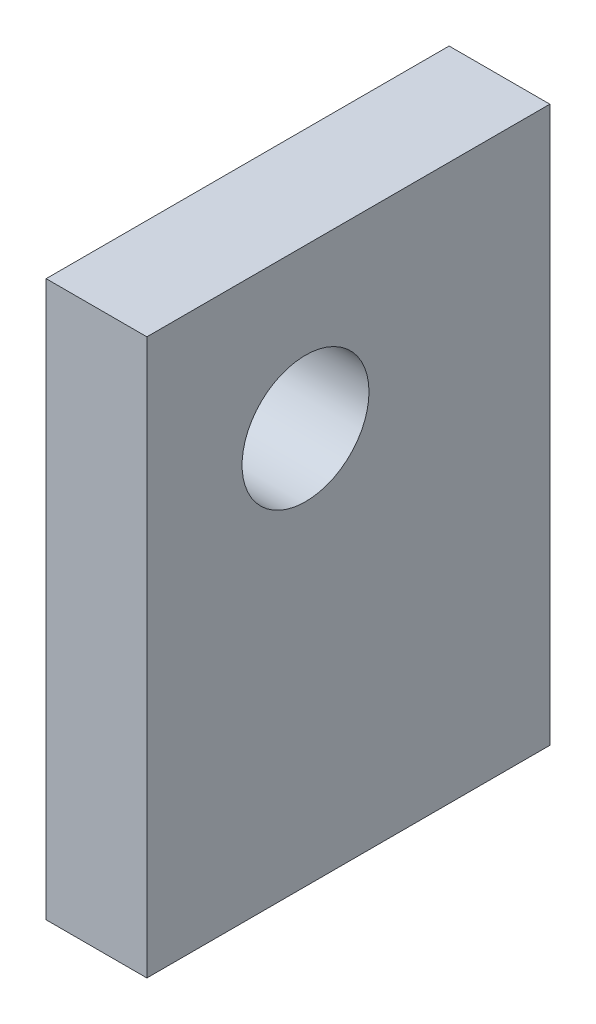
ISO-10303-21;
HEADER;
FILE_DESCRIPTION(('STEP AP214'),'2;1');
FILE_NAME('part.step','',(''),(''),'','','');
FILE_SCHEMA(('AUTOMOTIVE_DESIGN { 1 0 10303 214 1 1 1 1 }'));
ENDSEC;
DATA;
#1=APPLICATION_CONTEXT('core data for automotive mechanical design processes');
#2=APPLICATION_PROTOCOL_DEFINITION('international standard','automotive_design',2000,#1);
#3=PRODUCT_CONTEXT('',#1,'mechanical');
#4=PRODUCT('Part','Part','',(#3));
#5=PRODUCT_RELATED_PRODUCT_CATEGORY('part','',(#4));
#6=PRODUCT_DEFINITION_FORMATION('','',#4);
#7=PRODUCT_DEFINITION_CONTEXT('part definition',#1,'design');
#8=PRODUCT_DEFINITION('design','',#6,#7);
#9=PRODUCT_DEFINITION_SHAPE('','',#8);
#10=(LENGTH_UNIT() NAMED_UNIT(*) SI_UNIT(.MILLI.,.METRE.));
#11=(NAMED_UNIT(*) PLANE_ANGLE_UNIT() SI_UNIT($,.RADIAN.));
#12=(NAMED_UNIT(*) SI_UNIT($,.STERADIAN.) SOLID_ANGLE_UNIT());
#13=UNCERTAINTY_MEASURE_WITH_UNIT(LENGTH_MEASURE(1.E-05),#10,'distance_accuracy_value','');
#14=(GEOMETRIC_REPRESENTATION_CONTEXT(3) GLOBAL_UNCERTAINTY_ASSIGNED_CONTEXT((#13)) GLOBAL_UNIT_ASSIGNED_CONTEXT((#10,
#11,#12)) REPRESENTATION_CONTEXT('',''));
#15=CARTESIAN_POINT('',(0.,0.,0.));
#16=DIRECTION('',(0.,0.,1.));
#17=DIRECTION('',(1.,0.,0.));
#18=AXIS2_PLACEMENT_3D('',#15,#16,#17);
#19=CARTESIAN_POINT('',(0.,140.,0.));
#20=DIRECTION('',(1.,0.,0.));
#21=DIRECTION('',(0.,0.,-1.));
#22=AXIS2_PLACEMENT_3D('',#19,#20,#21);
#23=PLANE('',#22);
#24=CARTESIAN_POINT('',(0.,100.,-40.));
#25=DIRECTION('',(1.,0.,0.));
#26=DIRECTION('',(0.,0.,-1.));
#27=AXIS2_PLACEMENT_3D('',#24,#25,#26);
#28=CIRCLE('',#27,16.);
#29=CARTESIAN_POINT('',(0.,100.,-56.));
#30=VERTEX_POINT('',#29);
#31=EDGE_CURVE('E97',#30,#30,#28,.T.);
#32=ORIENTED_EDGE('',*,*,#31,.T.);
#33=EDGE_LOOP('',(#32));
#34=FACE_BOUND('',#33,.T.);
#35=DIRECTION('',(0.,0.,1.));
#36=VECTOR('',#35,1.);
#37=CARTESIAN_POINT('',(0.,0.,0.));
#38=LINE('',#37,#36);
#39=CARTESIAN_POINT('',(0.,0.,-101.6));
#40=VERTEX_POINT('',#39);
#41=CARTESIAN_POINT('',(0.,0.,0.));
#42=VERTEX_POINT('',#41);
#43=EDGE_CURVE('E94',#40,#42,#38,.T.);
#44=ORIENTED_EDGE('',*,*,#43,.T.);
#45=DIRECTION('',(0.,-1.,0.));
#46=VECTOR('',#45,1.);
#47=CARTESIAN_POINT('',(0.,140.,0.));
#48=LINE('',#47,#46);
#49=CARTESIAN_POINT('',(0.,140.,0.));
#50=VERTEX_POINT('',#49);
#51=EDGE_CURVE('E11',#50,#42,#48,.T.);
#52=ORIENTED_EDGE('',*,*,#51,.F.);
#53=DIRECTION('',(0.,0.,1.));
#54=VECTOR('',#53,1.);
#55=CARTESIAN_POINT('',(0.,140.,0.));
#56=LINE('',#55,#54);
#57=CARTESIAN_POINT('',(0.,140.,-101.6));
#58=VERTEX_POINT('',#57);
#59=EDGE_CURVE('E82',#58,#50,#56,.T.);
#60=ORIENTED_EDGE('',*,*,#59,.F.);
#61=DIRECTION('',(0.,-1.,0.));
#62=VECTOR('',#61,1.);
#63=CARTESIAN_POINT('',(0.,140.,-101.6));
#64=LINE('',#63,#62);
#65=EDGE_CURVE('E90',#58,#40,#64,.T.);
#66=ORIENTED_EDGE('',*,*,#65,.T.);
#67=EDGE_LOOP('',(#44,#52,#60,#66));
#68=FACE_BOUND('',#67,.T.);
#69=ADVANCED_FACE('F31',(#34,#68),#23,.F.);
#70=CARTESIAN_POINT('',(0.,140.,0.));
#71=DIRECTION('',(0.,0.,-1.));
#72=DIRECTION('',(-1.,0.,0.));
#73=AXIS2_PLACEMENT_3D('',#70,#71,#72);
#74=PLANE('',#73);
#75=DIRECTION('',(1.,0.,0.));
#76=VECTOR('',#75,1.);
#77=CARTESIAN_POINT('',(0.,0.,0.));
#78=LINE('',#77,#76);
#79=CARTESIAN_POINT('',(25.4,0.,0.));
#80=VERTEX_POINT('',#79);
#81=EDGE_CURVE('E86',#42,#80,#78,.T.);
#82=ORIENTED_EDGE('',*,*,#81,.T.);
#83=DIRECTION('',(0.,-1.,0.));
#84=VECTOR('',#83,1.);
#85=CARTESIAN_POINT('',(25.4,140.,0.));
#86=LINE('',#85,#84);
#87=CARTESIAN_POINT('',(25.4,140.,0.));
#88=VERTEX_POINT('',#87);
#89=EDGE_CURVE('E39',#88,#80,#86,.T.);
#90=ORIENTED_EDGE('',*,*,#89,.F.);
#91=DIRECTION('',(1.,0.,0.));
#92=VECTOR('',#91,1.);
#93=CARTESIAN_POINT('',(0.,140.,0.));
#94=LINE('',#93,#92);
#95=EDGE_CURVE('E77',#50,#88,#94,.T.);
#96=ORIENTED_EDGE('',*,*,#95,.F.);
#97=ORIENTED_EDGE('',*,*,#51,.T.);
#98=EDGE_LOOP('',(#82,#90,#96,#97));
#99=FACE_BOUND('',#98,.T.);
#100=ADVANCED_FACE('F85',(#99),#74,.F.);
#101=CARTESIAN_POINT('',(25.4,140.,0.));
#102=DIRECTION('',(-1.,0.,0.));
#103=DIRECTION('',(0.,0.,1.));
#104=AXIS2_PLACEMENT_3D('',#101,#102,#103);
#105=PLANE('',#104);
#106=CARTESIAN_POINT('',(25.4,100.,-40.));
#107=DIRECTION('',(1.,0.,0.));
#108=DIRECTION('',(0.,0.,-1.));
#109=AXIS2_PLACEMENT_3D('',#106,#107,#108);
#110=CIRCLE('',#109,16.);
#111=CARTESIAN_POINT('',(25.4,100.,-56.));
#112=VERTEX_POINT('',#111);
#113=EDGE_CURVE('E110',#112,#112,#110,.T.);
#114=ORIENTED_EDGE('',*,*,#113,.F.);
#115=EDGE_LOOP('',(#114));
#116=FACE_BOUND('',#115,.T.);
#117=DIRECTION('',(0.,0.,-1.));
#118=VECTOR('',#117,1.);
#119=CARTESIAN_POINT('',(25.4,0.,0.));
#120=LINE('',#119,#118);
#121=CARTESIAN_POINT('',(25.4,0.,-101.6));
#122=VERTEX_POINT('',#121);
#123=EDGE_CURVE('E64',#80,#122,#120,.T.);
#124=ORIENTED_EDGE('',*,*,#123,.T.);
#125=DIRECTION('',(0.,-1.,0.));
#126=VECTOR('',#125,1.);
#127=CARTESIAN_POINT('',(25.4,140.,-101.6));
#128=LINE('',#127,#126);
#129=CARTESIAN_POINT('',(25.4,140.,-101.6));
#130=VERTEX_POINT('',#129);
#131=EDGE_CURVE('E87',#130,#122,#128,.T.);
#132=ORIENTED_EDGE('',*,*,#131,.F.);
#133=DIRECTION('',(0.,0.,-1.));
#134=VECTOR('',#133,1.);
#135=CARTESIAN_POINT('',(25.4,140.,0.));
#136=LINE('',#135,#134);
#137=EDGE_CURVE('E80',#88,#130,#136,.T.);
#138=ORIENTED_EDGE('',*,*,#137,.F.);
#139=ORIENTED_EDGE('',*,*,#89,.T.);
#140=EDGE_LOOP('',(#124,#132,#138,#139));
#141=FACE_BOUND('',#140,.T.);
#142=ADVANCED_FACE('F88',(#116,#141),#105,.F.);
#143=CARTESIAN_POINT('',(0.,140.,-101.6));
#144=DIRECTION('',(0.,0.,1.));
#145=DIRECTION('',(1.,0.,0.));
#146=AXIS2_PLACEMENT_3D('',#143,#144,#145);
#147=PLANE('',#146);
#148=DIRECTION('',(-1.,0.,0.));
#149=VECTOR('',#148,1.);
#150=CARTESIAN_POINT('',(0.,0.,-101.6));
#151=LINE('',#150,#149);
#152=EDGE_CURVE('E70',#122,#40,#151,.T.);
#153=ORIENTED_EDGE('',*,*,#152,.T.);
#154=ORIENTED_EDGE('',*,*,#65,.F.);
#155=DIRECTION('',(-1.,0.,0.));
#156=VECTOR('',#155,1.);
#157=CARTESIAN_POINT('',(0.,140.,-101.6));
#158=LINE('',#157,#156);
#159=EDGE_CURVE('E47',#130,#58,#158,.T.);
#160=ORIENTED_EDGE('',*,*,#159,.F.);
#161=ORIENTED_EDGE('',*,*,#131,.T.);
#162=EDGE_LOOP('',(#153,#154,#160,#161));
#163=FACE_BOUND('',#162,.T.);
#164=ADVANCED_FACE('F102',(#163),#147,.F.);
#165=CARTESIAN_POINT('',(0.,140.,-101.6));
#166=DIRECTION('',(0.,-1.,0.));
#167=DIRECTION('',(0.,0.,-1.));
#168=AXIS2_PLACEMENT_3D('',#165,#166,#167);
#169=PLANE('',#168);
#170=ORIENTED_EDGE('',*,*,#59,.T.);
#171=ORIENTED_EDGE('',*,*,#95,.T.);
#172=ORIENTED_EDGE('',*,*,#137,.T.);
#173=ORIENTED_EDGE('',*,*,#159,.T.);
#174=EDGE_LOOP('',(#170,#171,#172,#173));
#175=FACE_BOUND('',#174,.T.);
#176=ADVANCED_FACE('F78',(#175),#169,.F.);
#177=CARTESIAN_POINT('',(0.,0.,-101.6));
#178=DIRECTION('',(0.,-1.,0.));
#179=DIRECTION('',(0.,0.,-1.));
#180=AXIS2_PLACEMENT_3D('',#177,#178,#179);
#181=PLANE('',#180);
#182=ORIENTED_EDGE('',*,*,#43,.F.);
#183=ORIENTED_EDGE('',*,*,#152,.F.);
#184=ORIENTED_EDGE('',*,*,#123,.F.);
#185=ORIENTED_EDGE('',*,*,#81,.F.);
#186=EDGE_LOOP('',(#182,#183,#184,#185));
#187=FACE_BOUND('',#186,.T.);
#188=ADVANCED_FACE('F105',(#187),#181,.T.);
#189=CARTESIAN_POINT('',(-474.6,100.,-40.));
#190=DIRECTION('',(1.,0.,0.));
#191=DIRECTION('',(0.,0.,-1.));
#192=AXIS2_PLACEMENT_3D('',#189,#190,#191);
#193=CYLINDRICAL_SURFACE('',#192,16.);
#194=ORIENTED_EDGE('',*,*,#113,.T.);
#195=EDGE_LOOP('',(#194));
#196=FACE_BOUND('',#195,.T.);
#197=ORIENTED_EDGE('',*,*,#31,.F.);
#198=EDGE_LOOP('',(#197));
#199=FACE_BOUND('',#198,.T.);
#200=ADVANCED_FACE('F114',(#196,#199),#193,.F.);
#201=CLOSED_SHELL('',(#69,#100,#142,#164,#176,#188,#200));
#202=MANIFOLD_SOLID_BREP('B2',#201);
#203=ADVANCED_BREP_SHAPE_REPRESENTATION('',(#18,#202),#14);
#204=SHAPE_DEFINITION_REPRESENTATION(#9,#203);
ENDSEC;
END-ISO-10303-21;
